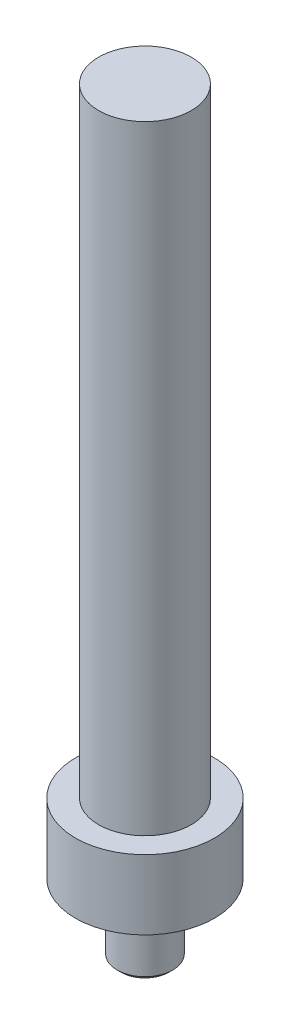
ISO-10303-21;
HEADER;
FILE_DESCRIPTION(('STEP AP214'),'2;1');
FILE_NAME('part.step','',(''),(''),'','','');
FILE_SCHEMA(('AUTOMOTIVE_DESIGN { 1 0 10303 214 1 1 1 1 }'));
ENDSEC;
DATA;
#1=APPLICATION_CONTEXT('core data for automotive mechanical design processes');
#2=APPLICATION_PROTOCOL_DEFINITION('international standard','automotive_design',2000,#1);
#3=PRODUCT_CONTEXT('',#1,'mechanical');
#4=PRODUCT('Part','Part','',(#3));
#5=PRODUCT_RELATED_PRODUCT_CATEGORY('part','',(#4));
#6=PRODUCT_DEFINITION_FORMATION('','',#4);
#7=PRODUCT_DEFINITION_CONTEXT('part definition',#1,'design');
#8=PRODUCT_DEFINITION('design','',#6,#7);
#9=PRODUCT_DEFINITION_SHAPE('','',#8);
#10=(LENGTH_UNIT() NAMED_UNIT(*) SI_UNIT(.MILLI.,.METRE.));
#11=(NAMED_UNIT(*) PLANE_ANGLE_UNIT() SI_UNIT($,.RADIAN.));
#12=(NAMED_UNIT(*) SI_UNIT($,.STERADIAN.) SOLID_ANGLE_UNIT());
#13=UNCERTAINTY_MEASURE_WITH_UNIT(LENGTH_MEASURE(1.E-05),#10,'distance_accuracy_value','');
#14=(GEOMETRIC_REPRESENTATION_CONTEXT(3) GLOBAL_UNCERTAINTY_ASSIGNED_CONTEXT((#13)) GLOBAL_UNIT_ASSIGNED_CONTEXT((#10,
#11,#12)) REPRESENTATION_CONTEXT('',''));
#15=CARTESIAN_POINT('',(0.,0.,0.));
#16=DIRECTION('',(0.,0.,1.));
#17=DIRECTION('',(1.,0.,0.));
#18=AXIS2_PLACEMENT_3D('',#15,#16,#17);
#19=CARTESIAN_POINT('',(0.,15.,0.));
#20=DIRECTION('',(0.,-1.,0.));
#21=DIRECTION('',(0.,0.,-1.));
#22=AXIS2_PLACEMENT_3D('',#19,#20,#21);
#23=CYLINDRICAL_SURFACE('',#22,15.);
#24=CARTESIAN_POINT('',(0.,15.,0.));
#25=DIRECTION('',(0.,1.,0.));
#26=DIRECTION('',(0.,0.,1.));
#27=AXIS2_PLACEMENT_3D('',#24,#25,#26);
#28=CIRCLE('',#27,15.);
#29=CARTESIAN_POINT('',(0.,15.,15.));
#30=VERTEX_POINT('',#29);
#31=EDGE_CURVE('E43',#30,#30,#28,.T.);
#32=ORIENTED_EDGE('',*,*,#31,.F.);
#33=EDGE_LOOP('',(#32));
#34=FACE_BOUND('',#33,.T.);
#35=CARTESIAN_POINT('',(0.,0.,0.));
#36=DIRECTION('',(0.,1.,0.));
#37=DIRECTION('',(0.,0.,1.));
#38=AXIS2_PLACEMENT_3D('',#35,#36,#37);
#39=CIRCLE('',#38,15.);
#40=CARTESIAN_POINT('',(0.,0.,15.));
#41=VERTEX_POINT('',#40);
#42=EDGE_CURVE('E39',#41,#41,#39,.T.);
#43=ORIENTED_EDGE('',*,*,#42,.T.);
#44=EDGE_LOOP('',(#43));
#45=FACE_BOUND('',#44,.T.);
#46=ADVANCED_FACE('F36',(#34,#45),#23,.T.);
#47=CARTESIAN_POINT('',(0.,15.,0.));
#48=DIRECTION('',(0.,1.,0.));
#49=DIRECTION('',(0.,0.,1.));
#50=AXIS2_PLACEMENT_3D('',#47,#48,#49);
#51=PLANE('',#50);
#52=CARTESIAN_POINT('',(0.,15.,0.));
#53=DIRECTION('',(0.,1.,0.));
#54=DIRECTION('',(0.,0.,1.));
#55=AXIS2_PLACEMENT_3D('',#52,#53,#54);
#56=CIRCLE('',#55,10.);
#57=CARTESIAN_POINT('',(0.,15.,10.));
#58=VERTEX_POINT('',#57);
#59=EDGE_CURVE('E10',#58,#58,#56,.T.);
#60=ORIENTED_EDGE('',*,*,#59,.F.);
#61=EDGE_LOOP('',(#60));
#62=FACE_BOUND('',#61,.T.);
#63=ORIENTED_EDGE('',*,*,#31,.T.);
#64=EDGE_LOOP('',(#63));
#65=FACE_BOUND('',#64,.T.);
#66=ADVANCED_FACE('F78',(#62,#65),#51,.T.);
#67=CARTESIAN_POINT('',(0.,0.,0.));
#68=DIRECTION('',(0.,1.,0.));
#69=DIRECTION('',(0.,0.,1.));
#70=AXIS2_PLACEMENT_3D('',#67,#68,#69);
#71=PLANE('',#70);
#72=ORIENTED_EDGE('',*,*,#42,.F.);
#73=EDGE_LOOP('',(#72));
#74=FACE_BOUND('',#73,.T.);
#75=CARTESIAN_POINT('',(0.,0.,0.));
#76=DIRECTION('',(0.,1.,0.));
#77=DIRECTION('',(0.,0.,1.));
#78=AXIS2_PLACEMENT_3D('',#75,#76,#77);
#79=CIRCLE('',#78,6.);
#80=CARTESIAN_POINT('',(0.,0.,6.));
#81=VERTEX_POINT('',#80);
#82=EDGE_CURVE('E52',#81,#81,#79,.T.);
#83=ORIENTED_EDGE('',*,*,#82,.T.);
#84=EDGE_LOOP('',(#83));
#85=FACE_BOUND('',#84,.T.);
#86=ADVANCED_FACE('F83',(#74,#85),#71,.F.);
#87=CARTESIAN_POINT('',(0.,148.5,0.));
#88=DIRECTION('',(0.,-1.,0.));
#89=DIRECTION('',(0.,0.,-1.));
#90=AXIS2_PLACEMENT_3D('',#87,#88,#89);
#91=CYLINDRICAL_SURFACE('',#90,10.);
#92=CARTESIAN_POINT('',(0.,148.5,0.));
#93=DIRECTION('',(0.,1.,0.));
#94=DIRECTION('',(0.,0.,1.));
#95=AXIS2_PLACEMENT_3D('',#92,#93,#94);
#96=CIRCLE('',#95,10.);
#97=CARTESIAN_POINT('',(0.,148.5,10.));
#98=VERTEX_POINT('',#97);
#99=EDGE_CURVE('E49',#98,#98,#96,.T.);
#100=ORIENTED_EDGE('',*,*,#99,.F.);
#101=EDGE_LOOP('',(#100));
#102=FACE_BOUND('',#101,.T.);
#103=ORIENTED_EDGE('',*,*,#59,.T.);
#104=EDGE_LOOP('',(#103));
#105=FACE_BOUND('',#104,.T.);
#106=ADVANCED_FACE('F93',(#102,#105),#91,.T.);
#107=CARTESIAN_POINT('',(0.,148.5,0.));
#108=DIRECTION('',(0.,1.,0.));
#109=DIRECTION('',(0.,0.,1.));
#110=AXIS2_PLACEMENT_3D('',#107,#108,#109);
#111=PLANE('',#110);
#112=ORIENTED_EDGE('',*,*,#99,.T.);
#113=EDGE_LOOP('',(#112));
#114=FACE_BOUND('',#113,.T.);
#115=ADVANCED_FACE('F97',(#114),#111,.T.);
#116=CARTESIAN_POINT('',(0.,-15.,0.));
#117=DIRECTION('',(0.,1.,0.));
#118=DIRECTION('',(0.,0.,1.));
#119=AXIS2_PLACEMENT_3D('',#116,#117,#118);
#120=CYLINDRICAL_SURFACE('',#119,6.);
#121=ORIENTED_EDGE('',*,*,#82,.F.);
#122=EDGE_LOOP('',(#121));
#123=FACE_BOUND('',#122,.T.);
#124=CARTESIAN_POINT('',(0.,-14.172,0.));
#125=DIRECTION('',(0.,1.,0.));
#126=DIRECTION('',(0.,0.,1.));
#127=AXIS2_PLACEMENT_3D('',#124,#125,#126);
#128=CIRCLE('',#127,6.);
#129=CARTESIAN_POINT('',(0.,-14.172,6.));
#130=VERTEX_POINT('',#129);
#131=EDGE_CURVE('E58',#130,#130,#128,.T.);
#132=ORIENTED_EDGE('',*,*,#131,.T.);
#133=EDGE_LOOP('',(#132));
#134=FACE_BOUND('',#133,.T.);
#135=ADVANCED_FACE('F62',(#123,#134),#120,.T.);
#136=CARTESIAN_POINT('',(0.,-15.,0.));
#137=DIRECTION('',(0.,1.,0.));
#138=DIRECTION('',(0.,0.,1.));
#139=AXIS2_PLACEMENT_3D('',#136,#137,#138);
#140=CONICAL_SURFACE('',#139,5.172,0.785398163397448);
#141=ORIENTED_EDGE('',*,*,#131,.F.);
#142=EDGE_LOOP('',(#141));
#143=FACE_BOUND('',#142,.T.);
#144=CARTESIAN_POINT('',(0.,-15.,0.));
#145=DIRECTION('',(0.,1.,0.));
#146=DIRECTION('',(0.,0.,1.));
#147=AXIS2_PLACEMENT_3D('',#144,#145,#146);
#148=CIRCLE('',#147,5.172);
#149=CARTESIAN_POINT('',(0.,-15.,5.172));
#150=VERTEX_POINT('',#149);
#151=EDGE_CURVE('E55',#150,#150,#148,.T.);
#152=ORIENTED_EDGE('',*,*,#151,.T.);
#153=EDGE_LOOP('',(#152));
#154=FACE_BOUND('',#153,.T.);
#155=ADVANCED_FACE('F64',(#143,#154),#140,.T.);
#156=CARTESIAN_POINT('',(0.,-15.,0.));
#157=DIRECTION('',(0.,-1.,0.));
#158=DIRECTION('',(0.,0.,-1.));
#159=AXIS2_PLACEMENT_3D('',#156,#157,#158);
#160=PLANE('',#159);
#161=ORIENTED_EDGE('',*,*,#151,.F.);
#162=EDGE_LOOP('',(#161));
#163=FACE_BOUND('',#162,.T.);
#164=ADVANCED_FACE('F67',(#163),#160,.T.);
#165=CLOSED_SHELL('',(#46,#66,#86,#106,#115,#135,#155,#164));
#166=MANIFOLD_SOLID_BREP('B2',#165);
#167=ADVANCED_BREP_SHAPE_REPRESENTATION('',(#18,#166),#14);
#168=SHAPE_DEFINITION_REPRESENTATION(#9,#167);
ENDSEC;
END-ISO-10303-21;
